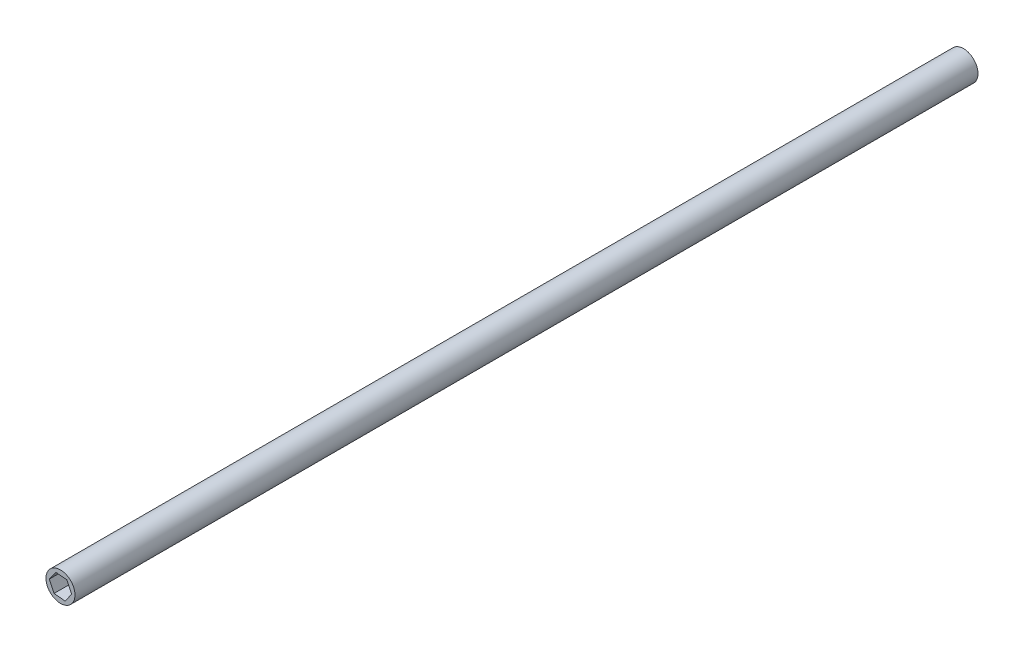
ISO-10303-21;
HEADER;
FILE_DESCRIPTION(('STEP AP214'),'2;1');
FILE_NAME('part.step','',(''),(''),'','','');
FILE_SCHEMA(('AUTOMOTIVE_DESIGN { 1 0 10303 214 1 1 1 1 }'));
ENDSEC;
DATA;
#1=APPLICATION_CONTEXT('core data for automotive mechanical design processes');
#2=APPLICATION_PROTOCOL_DEFINITION('international standard','automotive_design',2000,#1);
#3=PRODUCT_CONTEXT('',#1,'mechanical');
#4=PRODUCT('Part','Part','',(#3));
#5=PRODUCT_RELATED_PRODUCT_CATEGORY('part','',(#4));
#6=PRODUCT_DEFINITION_FORMATION('','',#4);
#7=PRODUCT_DEFINITION_CONTEXT('part definition',#1,'design');
#8=PRODUCT_DEFINITION('design','',#6,#7);
#9=PRODUCT_DEFINITION_SHAPE('','',#8);
#10=(LENGTH_UNIT() NAMED_UNIT(*) SI_UNIT(.MILLI.,.METRE.));
#11=(NAMED_UNIT(*) PLANE_ANGLE_UNIT() SI_UNIT($,.RADIAN.));
#12=(NAMED_UNIT(*) SI_UNIT($,.STERADIAN.) SOLID_ANGLE_UNIT());
#13=UNCERTAINTY_MEASURE_WITH_UNIT(LENGTH_MEASURE(1.E-05),#10,'distance_accuracy_value','');
#14=(GEOMETRIC_REPRESENTATION_CONTEXT(3) GLOBAL_UNCERTAINTY_ASSIGNED_CONTEXT((#13)) GLOBAL_UNIT_ASSIGNED_CONTEXT((#10,
#11,#12)) REPRESENTATION_CONTEXT('',''));
#15=CARTESIAN_POINT('',(0.,0.,0.));
#16=DIRECTION('',(0.,0.,1.));
#17=DIRECTION('',(1.,0.,0.));
#18=AXIS2_PLACEMENT_3D('',#15,#16,#17);
#19=CARTESIAN_POINT('',(0.,0.,600.));
#20=DIRECTION('',(0.,0.,1.));
#21=DIRECTION('',(1.,0.,0.));
#22=AXIS2_PLACEMENT_3D('',#19,#20,#21);
#23=PLANE('',#22);
#24=CARTESIAN_POINT('',(0.,0.,600.));
#25=DIRECTION('',(0.,0.,1.));
#26=DIRECTION('',(1.,0.,0.));
#27=AXIS2_PLACEMENT_3D('',#24,#25,#26);
#28=CIRCLE('',#27,10.);
#29=CARTESIAN_POINT('',(10.,0.,600.));
#30=VERTEX_POINT('',#29);
#31=EDGE_CURVE('E11',#30,#30,#28,.T.);
#32=ORIENTED_EDGE('',*,*,#31,.T.);
#33=EDGE_LOOP('',(#32));
#34=FACE_BOUND('',#33,.T.);
#35=DIRECTION('',(-0.418426814550838,0.908250516578349,0.));
#36=VECTOR('',#35,1.);
#37=CARTESIAN_POINT('',(7.66552900396956,-0.706345771248589,600.));
#38=LINE('',#37,#36);
#39=CARTESIAN_POINT('',(7.66552900396956,-0.706345771248589,600.));
#40=VERTEX_POINT('',#39);
#41=CARTESIAN_POINT('',(4.44447788374177,6.28536996525977,600.));
#42=VERTEX_POINT('',#41);
#43=EDGE_CURVE('E108',#40,#42,#38,.T.);
#44=ORIENTED_EDGE('',*,*,#43,.F.);
#45=DIRECTION('',(0.577354613081771,0.816493509314801,0.));
#46=VECTOR('',#45,1.);
#47=CARTESIAN_POINT('',(3.22105112022778,-6.99171573650836,600.));
#48=LINE('',#47,#46);
#49=CARTESIAN_POINT('',(3.22105112022778,-6.99171573650836,600.));
#50=VERTEX_POINT('',#49);
#51=EDGE_CURVE('E88',#50,#40,#48,.T.);
#52=ORIENTED_EDGE('',*,*,#51,.F.);
#53=DIRECTION('',(0.995781427632609,-0.0917570072635488,0.));
#54=VECTOR('',#53,1.);
#55=CARTESIAN_POINT('',(-4.44447788374178,-6.28536996525977,600.));
#56=LINE('',#55,#54);
#57=CARTESIAN_POINT('',(-4.44447788374178,-6.28536996525977,600.));
#58=VERTEX_POINT('',#57);
#59=EDGE_CURVE('E59',#58,#50,#56,.T.);
#60=ORIENTED_EDGE('',*,*,#59,.F.);
#61=DIRECTION('',(0.418426814550838,-0.908250516578349,0.));
#62=VECTOR('',#61,1.);
#63=CARTESIAN_POINT('',(-7.66552900396956,0.706345771248588,600.));
#64=LINE('',#63,#62);
#65=CARTESIAN_POINT('',(-7.66552900396956,0.706345771248588,600.));
#66=VERTEX_POINT('',#65);
#67=EDGE_CURVE('E119',#66,#58,#64,.T.);
#68=ORIENTED_EDGE('',*,*,#67,.F.);
#69=DIRECTION('',(-0.577354613081771,-0.816493509314801,0.));
#70=VECTOR('',#69,1.);
#71=CARTESIAN_POINT('',(-3.22105112022779,6.99171573650836,600.));
#72=LINE('',#71,#70);
#73=CARTESIAN_POINT('',(-3.22105112022779,6.99171573650836,600.));
#74=VERTEX_POINT('',#73);
#75=EDGE_CURVE('E107',#74,#66,#72,.T.);
#76=ORIENTED_EDGE('',*,*,#75,.F.);
#77=DIRECTION('',(-0.995781427632609,0.0917570072635489,0.));
#78=VECTOR('',#77,1.);
#79=CARTESIAN_POINT('',(4.44447788374177,6.28536996525977,600.));
#80=LINE('',#79,#78);
#81=EDGE_CURVE('E97',#42,#74,#80,.T.);
#82=ORIENTED_EDGE('',*,*,#81,.F.);
#83=EDGE_LOOP('',(#44,#52,#60,#68,#76,#82));
#84=FACE_BOUND('',#83,.T.);
#85=ADVANCED_FACE('F38',(#34,#84),#23,.T.);
#86=CARTESIAN_POINT('',(0.,0.,600.));
#87=DIRECTION('',(0.,0.,-1.));
#88=DIRECTION('',(-1.,0.,0.));
#89=AXIS2_PLACEMENT_3D('',#86,#87,#88);
#90=CYLINDRICAL_SURFACE('',#89,10.);
#91=ORIENTED_EDGE('',*,*,#31,.F.);
#92=EDGE_LOOP('',(#91));
#93=FACE_BOUND('',#92,.T.);
#94=CARTESIAN_POINT('',(0.,0.,-22.5));
#95=DIRECTION('',(0.,0.,1.));
#96=DIRECTION('',(1.,0.,0.));
#97=AXIS2_PLACEMENT_3D('',#94,#95,#96);
#98=CIRCLE('',#97,10.);
#99=CARTESIAN_POINT('',(10.,0.,-22.5));
#100=VERTEX_POINT('',#99);
#101=EDGE_CURVE('E130',#100,#100,#98,.T.);
#102=ORIENTED_EDGE('',*,*,#101,.T.);
#103=EDGE_LOOP('',(#102));
#104=FACE_BOUND('',#103,.T.);
#105=ADVANCED_FACE('F40',(#93,#104),#90,.T.);
#106=CARTESIAN_POINT('',(3.22105112022778,-6.99171573650836,600.));
#107=DIRECTION('',(-0.816493509314801,0.577354613081771,0.));
#108=DIRECTION('',(-0.577354613081771,-0.816493509314801,0.));
#109=AXIS2_PLACEMENT_3D('',#106,#107,#108);
#110=PLANE('',#109);
#111=DIRECTION('',(0.577354613081771,0.816493509314801,0.));
#112=VECTOR('',#111,1.);
#113=CARTESIAN_POINT('',(3.22105112022778,-6.99171573650836,0.));
#114=LINE('',#113,#112);
#115=CARTESIAN_POINT('',(3.22105112022778,-6.99171573650836,0.));
#116=VERTEX_POINT('',#115);
#117=CARTESIAN_POINT('',(7.66552900396956,-0.706345771248589,0.));
#118=VERTEX_POINT('',#117);
#119=EDGE_CURVE('E126',#116,#118,#114,.T.);
#120=ORIENTED_EDGE('',*,*,#119,.F.);
#121=DIRECTION('',(0.,0.,-1.));
#122=VECTOR('',#121,1.);
#123=CARTESIAN_POINT('',(3.22105112022778,-6.99171573650836,600.));
#124=LINE('',#123,#122);
#125=EDGE_CURVE('E125',#50,#116,#124,.T.);
#126=ORIENTED_EDGE('',*,*,#125,.F.);
#127=ORIENTED_EDGE('',*,*,#51,.T.);
#128=DIRECTION('',(0.,0.,-1.));
#129=VECTOR('',#128,1.);
#130=CARTESIAN_POINT('',(7.66552900396956,-0.706345771248589,600.));
#131=LINE('',#130,#129);
#132=EDGE_CURVE('E46',#40,#118,#131,.T.);
#133=ORIENTED_EDGE('',*,*,#132,.T.);
#134=EDGE_LOOP('',(#120,#126,#127,#133));
#135=FACE_BOUND('',#134,.T.);
#136=ADVANCED_FACE('F146',(#135),#110,.T.);
#137=CARTESIAN_POINT('',(7.66552900396956,-0.706345771248589,600.));
#138=DIRECTION('',(-0.908250516578349,-0.418426814550838,0.));
#139=DIRECTION('',(0.418426814550838,-0.908250516578349,0.));
#140=AXIS2_PLACEMENT_3D('',#137,#138,#139);
#141=PLANE('',#140);
#142=DIRECTION('',(-0.418426814550838,0.908250516578349,0.));
#143=VECTOR('',#142,1.);
#144=CARTESIAN_POINT('',(7.66552900396956,-0.706345771248589,0.));
#145=LINE('',#144,#143);
#146=CARTESIAN_POINT('',(4.44447788374177,6.28536996525977,0.));
#147=VERTEX_POINT('',#146);
#148=EDGE_CURVE('E129',#118,#147,#145,.T.);
#149=ORIENTED_EDGE('',*,*,#148,.F.);
#150=ORIENTED_EDGE('',*,*,#132,.F.);
#151=ORIENTED_EDGE('',*,*,#43,.T.);
#152=DIRECTION('',(0.,0.,-1.));
#153=VECTOR('',#152,1.);
#154=CARTESIAN_POINT('',(4.44447788374177,6.28536996525977,600.));
#155=LINE('',#154,#153);
#156=EDGE_CURVE('E103',#42,#147,#155,.T.);
#157=ORIENTED_EDGE('',*,*,#156,.T.);
#158=EDGE_LOOP('',(#149,#150,#151,#157));
#159=FACE_BOUND('',#158,.T.);
#160=ADVANCED_FACE('F173',(#159),#141,.T.);
#161=CARTESIAN_POINT('',(4.44447788374177,6.28536996525977,600.));
#162=DIRECTION('',(-0.0917570072635489,-0.995781427632609,0.));
#163=DIRECTION('',(0.995781427632609,-0.0917570072635489,0.));
#164=AXIS2_PLACEMENT_3D('',#161,#162,#163);
#165=PLANE('',#164);
#166=DIRECTION('',(-0.995781427632609,0.0917570072635489,0.));
#167=VECTOR('',#166,1.);
#168=CARTESIAN_POINT('',(4.44447788374177,6.28536996525977,0.));
#169=LINE('',#168,#167);
#170=CARTESIAN_POINT('',(-3.22105112022779,6.99171573650836,0.));
#171=VERTEX_POINT('',#170);
#172=EDGE_CURVE('E133',#147,#171,#169,.T.);
#173=ORIENTED_EDGE('',*,*,#172,.F.);
#174=ORIENTED_EDGE('',*,*,#156,.F.);
#175=ORIENTED_EDGE('',*,*,#81,.T.);
#176=DIRECTION('',(0.,0.,-1.));
#177=VECTOR('',#176,1.);
#178=CARTESIAN_POINT('',(-3.22105112022779,6.99171573650836,600.));
#179=LINE('',#178,#177);
#180=EDGE_CURVE('E101',#74,#171,#179,.T.);
#181=ORIENTED_EDGE('',*,*,#180,.T.);
#182=EDGE_LOOP('',(#173,#174,#175,#181));
#183=FACE_BOUND('',#182,.T.);
#184=ADVANCED_FACE('F100',(#183),#165,.T.);
#185=CARTESIAN_POINT('',(-3.22105112022779,6.99171573650836,600.));
#186=DIRECTION('',(0.816493509314801,-0.577354613081771,0.));
#187=DIRECTION('',(0.577354613081771,0.816493509314801,0.));
#188=AXIS2_PLACEMENT_3D('',#185,#186,#187);
#189=PLANE('',#188);
#190=DIRECTION('',(-0.577354613081771,-0.816493509314801,0.));
#191=VECTOR('',#190,1.);
#192=CARTESIAN_POINT('',(-3.22105112022779,6.99171573650836,0.));
#193=LINE('',#192,#191);
#194=CARTESIAN_POINT('',(-7.66552900396956,0.706345771248588,0.));
#195=VERTEX_POINT('',#194);
#196=EDGE_CURVE('E114',#171,#195,#193,.T.);
#197=ORIENTED_EDGE('',*,*,#196,.F.);
#198=ORIENTED_EDGE('',*,*,#180,.F.);
#199=ORIENTED_EDGE('',*,*,#75,.T.);
#200=DIRECTION('',(0.,0.,-1.));
#201=VECTOR('',#200,1.);
#202=CARTESIAN_POINT('',(-7.66552900396956,0.706345771248588,600.));
#203=LINE('',#202,#201);
#204=EDGE_CURVE('E116',#66,#195,#203,.T.);
#205=ORIENTED_EDGE('',*,*,#204,.T.);
#206=EDGE_LOOP('',(#197,#198,#199,#205));
#207=FACE_BOUND('',#206,.T.);
#208=ADVANCED_FACE('F111',(#207),#189,.T.);
#209=CARTESIAN_POINT('',(-7.66552900396956,0.706345771248588,600.));
#210=DIRECTION('',(0.908250516578349,0.418426814550838,0.));
#211=DIRECTION('',(-0.418426814550838,0.90825051657835,0.));
#212=AXIS2_PLACEMENT_3D('',#209,#210,#211);
#213=PLANE('',#212);
#214=DIRECTION('',(0.418426814550838,-0.908250516578349,0.));
#215=VECTOR('',#214,1.);
#216=CARTESIAN_POINT('',(-7.66552900396956,0.706345771248588,0.));
#217=LINE('',#216,#215);
#218=CARTESIAN_POINT('',(-4.44447788374178,-6.28536996525977,0.));
#219=VERTEX_POINT('',#218);
#220=EDGE_CURVE('E136',#195,#219,#217,.T.);
#221=ORIENTED_EDGE('',*,*,#220,.F.);
#222=ORIENTED_EDGE('',*,*,#204,.F.);
#223=ORIENTED_EDGE('',*,*,#67,.T.);
#224=DIRECTION('',(0.,0.,-1.));
#225=VECTOR('',#224,1.);
#226=CARTESIAN_POINT('',(-4.44447788374178,-6.28536996525977,600.));
#227=LINE('',#226,#225);
#228=EDGE_CURVE('E53',#58,#219,#227,.T.);
#229=ORIENTED_EDGE('',*,*,#228,.T.);
#230=EDGE_LOOP('',(#221,#222,#223,#229));
#231=FACE_BOUND('',#230,.T.);
#232=ADVANCED_FACE('F180',(#231),#213,.T.);
#233=CARTESIAN_POINT('',(-4.44447788374178,-6.28536996525977,600.));
#234=DIRECTION('',(0.0917570072635488,0.995781427632609,0.));
#235=DIRECTION('',(-0.995781427632609,0.0917570072635488,0.));
#236=AXIS2_PLACEMENT_3D('',#233,#234,#235);
#237=PLANE('',#236);
#238=DIRECTION('',(0.995781427632609,-0.0917570072635488,0.));
#239=VECTOR('',#238,1.);
#240=CARTESIAN_POINT('',(-4.44447788374178,-6.28536996525977,0.));
#241=LINE('',#240,#239);
#242=EDGE_CURVE('E139',#219,#116,#241,.T.);
#243=ORIENTED_EDGE('',*,*,#242,.F.);
#244=ORIENTED_EDGE('',*,*,#228,.F.);
#245=ORIENTED_EDGE('',*,*,#59,.T.);
#246=ORIENTED_EDGE('',*,*,#125,.T.);
#247=EDGE_LOOP('',(#243,#244,#245,#246));
#248=FACE_BOUND('',#247,.T.);
#249=ADVANCED_FACE('F150',(#248),#237,.T.);
#250=CARTESIAN_POINT('',(0.,0.,0.));
#251=DIRECTION('',(0.,0.,1.));
#252=DIRECTION('',(1.,0.,0.));
#253=AXIS2_PLACEMENT_3D('',#250,#251,#252);
#254=PLANE('',#253);
#255=ORIENTED_EDGE('',*,*,#242,.T.);
#256=ORIENTED_EDGE('',*,*,#119,.T.);
#257=ORIENTED_EDGE('',*,*,#148,.T.);
#258=ORIENTED_EDGE('',*,*,#172,.T.);
#259=ORIENTED_EDGE('',*,*,#196,.T.);
#260=ORIENTED_EDGE('',*,*,#220,.T.);
#261=EDGE_LOOP('',(#255,#256,#257,#258,#259,#260));
#262=FACE_BOUND('',#261,.T.);
#263=ADVANCED_FACE('F149',(#262),#254,.T.);
#264=CARTESIAN_POINT('',(0.,0.,-22.5));
#265=DIRECTION('',(0.,0.,1.));
#266=DIRECTION('',(1.,0.,0.));
#267=AXIS2_PLACEMENT_3D('',#264,#265,#266);
#268=PLANE('',#267);
#269=ORIENTED_EDGE('',*,*,#101,.F.);
#270=EDGE_LOOP('',(#269));
#271=FACE_BOUND('',#270,.T.);
#272=ADVANCED_FACE('F157',(#271),#268,.F.);
#273=CLOSED_SHELL('',(#85,#105,#136,#160,#184,#208,#232,#249,#263,#272));
#274=MANIFOLD_SOLID_BREP('B2',#273);
#275=ADVANCED_BREP_SHAPE_REPRESENTATION('',(#18,#274),#14);
#276=SHAPE_DEFINITION_REPRESENTATION(#9,#275);
ENDSEC;
END-ISO-10303-21;
